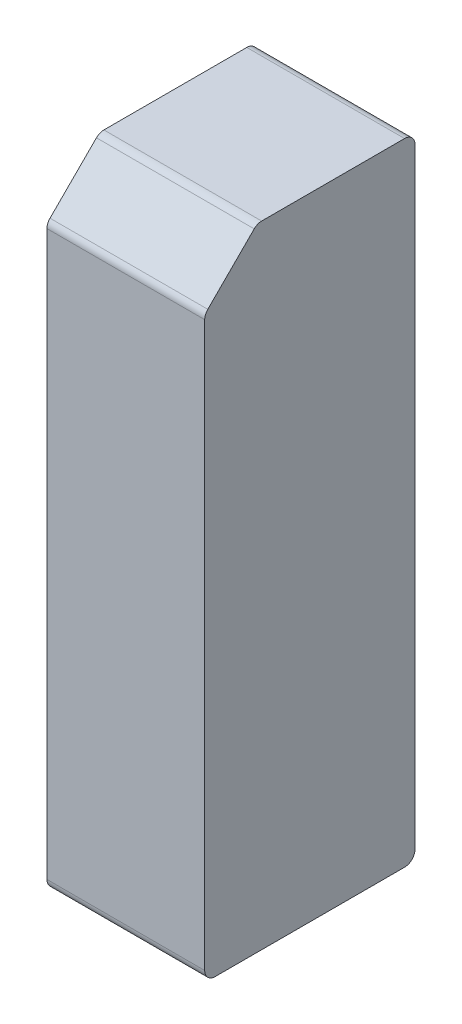
ISO-10303-21;
HEADER;
FILE_DESCRIPTION(('STEP AP214'),'2;1');
FILE_NAME('part.step','',(''),(''),'','','');
FILE_SCHEMA(('AUTOMOTIVE_DESIGN { 1 0 10303 214 1 1 1 1 }'));
ENDSEC;
DATA;
#1=APPLICATION_CONTEXT('core data for automotive mechanical design processes');
#2=APPLICATION_PROTOCOL_DEFINITION('international standard','automotive_design',2000,#1);
#3=PRODUCT_CONTEXT('',#1,'mechanical');
#4=PRODUCT('Part','Part','',(#3));
#5=PRODUCT_RELATED_PRODUCT_CATEGORY('part','',(#4));
#6=PRODUCT_DEFINITION_FORMATION('','',#4);
#7=PRODUCT_DEFINITION_CONTEXT('part definition',#1,'design');
#8=PRODUCT_DEFINITION('design','',#6,#7);
#9=PRODUCT_DEFINITION_SHAPE('','',#8);
#10=(LENGTH_UNIT() NAMED_UNIT(*) SI_UNIT(.MILLI.,.METRE.));
#11=(NAMED_UNIT(*) PLANE_ANGLE_UNIT() SI_UNIT($,.RADIAN.));
#12=(NAMED_UNIT(*) SI_UNIT($,.STERADIAN.) SOLID_ANGLE_UNIT());
#13=UNCERTAINTY_MEASURE_WITH_UNIT(LENGTH_MEASURE(1.E-05),#10,'distance_accuracy_value','');
#14=(GEOMETRIC_REPRESENTATION_CONTEXT(3) GLOBAL_UNCERTAINTY_ASSIGNED_CONTEXT((#13)) GLOBAL_UNIT_ASSIGNED_CONTEXT((#10,
#11,#12)) REPRESENTATION_CONTEXT('',''));
#15=CARTESIAN_POINT('',(0.,0.,0.));
#16=DIRECTION('',(0.,0.,1.));
#17=DIRECTION('',(1.,0.,0.));
#18=AXIS2_PLACEMENT_3D('',#15,#16,#17);
#19=CARTESIAN_POINT('',(9.525,20.6375,3.175));
#20=DIRECTION('',(0.,-1.,0.));
#21=DIRECTION('',(0.,0.,-1.));
#22=AXIS2_PLACEMENT_3D('',#19,#20,#21);
#23=PLANE('',#22);
#24=DIRECTION('',(0.,0.,1.));
#25=VECTOR('',#24,1.);
#26=CARTESIAN_POINT('',(9.525,20.6375,3.175));
#27=LINE('',#26,#25);
#28=CARTESIAN_POINT('',(9.525,20.6375,-5.715));
#29=VERTEX_POINT('',#28);
#30=CARTESIAN_POINT('',(9.525,20.6375,2.91197438789309));
#31=VERTEX_POINT('',#30);
#32=EDGE_CURVE('E212',#29,#31,#27,.T.);
#33=ORIENTED_EDGE('',*,*,#32,.F.);
#34=DIRECTION('',(-1.,0.,0.));
#35=VECTOR('',#34,1.);
#36=CARTESIAN_POINT('',(9.525,20.6375,-5.715));
#37=LINE('',#36,#35);
#38=CARTESIAN_POINT('',(0.,20.6375,-5.715));
#39=VERTEX_POINT('',#38);
#40=EDGE_CURVE('E199',#29,#39,#37,.T.);
#41=ORIENTED_EDGE('',*,*,#40,.T.);
#42=DIRECTION('',(0.,0.,1.));
#43=VECTOR('',#42,1.);
#44=CARTESIAN_POINT('',(0.,20.6375,3.175));
#45=LINE('',#44,#43);
#46=CARTESIAN_POINT('',(0.,20.6375,2.91197438789309));
#47=VERTEX_POINT('',#46);
#48=EDGE_CURVE('E221',#39,#47,#45,.T.);
#49=ORIENTED_EDGE('',*,*,#48,.T.);
#50=DIRECTION('',(-1.,0.,0.));
#51=VECTOR('',#50,1.);
#52=CARTESIAN_POINT('',(9.525,20.6375,2.91197438789309));
#53=LINE('',#52,#51);
#54=EDGE_CURVE('E196',#47,#31,#53,.F.);
#55=ORIENTED_EDGE('',*,*,#54,.T.);
#56=EDGE_LOOP('',(#33,#41,#49,#55));
#57=FACE_BOUND('',#56,.T.);
#58=ADVANCED_FACE('F38',(#57),#23,.F.);
#59=CARTESIAN_POINT('',(9.525,17.4625,6.35));
#60=DIRECTION('',(0.,-0.707106781186546,-0.707106781186549));
#61=DIRECTION('',(0.,0.707106781186549,-0.707106781186546));
#62=AXIS2_PLACEMENT_3D('',#59,#60,#61);
#63=PLANE('',#62);
#64=DIRECTION('',(0.,-0.707106781186549,0.707106781186546));
#65=VECTOR('',#64,1.);
#66=CARTESIAN_POINT('',(9.525,17.4625,6.35));
#67=LINE('',#66,#65);
#68=CARTESIAN_POINT('',(9.525,20.4515128060535,3.36098719394654));
#69=VERTEX_POINT('',#68);
#70=CARTESIAN_POINT('',(9.525,17.6484871939465,6.16401280605346));
#71=VERTEX_POINT('',#70);
#72=EDGE_CURVE('E209',#69,#71,#67,.T.);
#73=ORIENTED_EDGE('',*,*,#72,.F.);
#74=DIRECTION('',(-1.,0.,0.));
#75=VECTOR('',#74,1.);
#76=CARTESIAN_POINT('',(9.525,20.4515128060535,3.36098719394654));
#77=LINE('',#76,#75);
#78=CARTESIAN_POINT('',(0.,20.4515128060535,3.36098719394654));
#79=VERTEX_POINT('',#78);
#80=EDGE_CURVE('E11',#69,#79,#77,.T.);
#81=ORIENTED_EDGE('',*,*,#80,.T.);
#82=DIRECTION('',(0.,-0.707106781186549,0.707106781186546));
#83=VECTOR('',#82,1.);
#84=CARTESIAN_POINT('',(0.,17.4625,6.35));
#85=LINE('',#84,#83);
#86=CARTESIAN_POINT('',(0.,17.6484871939465,6.16401280605346));
#87=VERTEX_POINT('',#86);
#88=EDGE_CURVE('E154',#79,#87,#85,.T.);
#89=ORIENTED_EDGE('',*,*,#88,.T.);
#90=DIRECTION('',(-1.,0.,0.));
#91=VECTOR('',#90,1.);
#92=CARTESIAN_POINT('',(9.525,17.6484871939465,6.16401280605346));
#93=LINE('',#92,#91);
#94=EDGE_CURVE('E47',#87,#71,#93,.F.);
#95=ORIENTED_EDGE('',*,*,#94,.T.);
#96=EDGE_LOOP('',(#73,#81,#89,#95));
#97=FACE_BOUND('',#96,.T.);
#98=ADVANCED_FACE('F226',(#97),#63,.F.);
#99=CARTESIAN_POINT('',(9.525,-17.4625,6.35));
#100=DIRECTION('',(0.,0.,-1.));
#101=DIRECTION('',(-1.,0.,0.));
#102=AXIS2_PLACEMENT_3D('',#99,#100,#101);
#103=PLANE('',#102);
#104=DIRECTION('',(0.,-1.,0.));
#105=VECTOR('',#104,1.);
#106=CARTESIAN_POINT('',(0.,-17.4625,6.35));
#107=LINE('',#106,#105);
#108=CARTESIAN_POINT('',(0.,17.1994743878931,6.35));
#109=VERTEX_POINT('',#108);
#110=CARTESIAN_POINT('',(0.,-16.8275,6.35));
#111=VERTEX_POINT('',#110);
#112=EDGE_CURVE('E147',#109,#111,#107,.T.);
#113=ORIENTED_EDGE('',*,*,#112,.T.);
#114=DIRECTION('',(-1.,0.,0.));
#115=VECTOR('',#114,1.);
#116=CARTESIAN_POINT('',(9.525,-16.8275,6.35));
#117=LINE('',#116,#115);
#118=CARTESIAN_POINT('',(9.525,-16.8275,6.35));
#119=VERTEX_POINT('',#118);
#120=EDGE_CURVE('E122',#111,#119,#117,.F.);
#121=ORIENTED_EDGE('',*,*,#120,.T.);
#122=DIRECTION('',(0.,-1.,0.));
#123=VECTOR('',#122,1.);
#124=CARTESIAN_POINT('',(9.525,-17.4625,6.35));
#125=LINE('',#124,#123);
#126=CARTESIAN_POINT('',(9.525,17.1994743878931,6.35));
#127=VERTEX_POINT('',#126);
#128=EDGE_CURVE('E205',#127,#119,#125,.T.);
#129=ORIENTED_EDGE('',*,*,#128,.F.);
#130=DIRECTION('',(-1.,0.,0.));
#131=VECTOR('',#130,1.);
#132=CARTESIAN_POINT('',(9.525,17.1994743878931,6.35));
#133=LINE('',#132,#131);
#134=EDGE_CURVE('E128',#127,#109,#133,.T.);
#135=ORIENTED_EDGE('',*,*,#134,.T.);
#136=EDGE_LOOP('',(#113,#121,#129,#135));
#137=FACE_BOUND('',#136,.T.);
#138=ADVANCED_FACE('F234',(#137),#103,.F.);
#139=CARTESIAN_POINT('',(9.525,-17.4625,6.35));
#140=DIRECTION('',(0.,1.,0.));
#141=DIRECTION('',(0.,0.,1.));
#142=AXIS2_PLACEMENT_3D('',#139,#140,#141);
#143=PLANE('',#142);
#144=DIRECTION('',(0.,0.,-1.));
#145=VECTOR('',#144,1.);
#146=CARTESIAN_POINT('',(9.525,-17.4625,6.35));
#147=LINE('',#146,#145);
#148=CARTESIAN_POINT('',(9.525,-17.4625,5.715));
#149=VERTEX_POINT('',#148);
#150=CARTESIAN_POINT('',(9.525,-17.4625,-5.715));
#151=VERTEX_POINT('',#150);
#152=EDGE_CURVE('E138',#149,#151,#147,.T.);
#153=ORIENTED_EDGE('',*,*,#152,.F.);
#154=DIRECTION('',(-1.,0.,0.));
#155=VECTOR('',#154,1.);
#156=CARTESIAN_POINT('',(9.525,-17.4625,5.715));
#157=LINE('',#156,#155);
#158=CARTESIAN_POINT('',(0.,-17.4625,5.715));
#159=VERTEX_POINT('',#158);
#160=EDGE_CURVE('E121',#149,#159,#157,.T.);
#161=ORIENTED_EDGE('',*,*,#160,.T.);
#162=DIRECTION('',(0.,0.,-1.));
#163=VECTOR('',#162,1.);
#164=CARTESIAN_POINT('',(0.,-17.4625,6.35));
#165=LINE('',#164,#163);
#166=CARTESIAN_POINT('',(0.,-17.4625,-5.715));
#167=VERTEX_POINT('',#166);
#168=EDGE_CURVE('E135',#159,#167,#165,.T.);
#169=ORIENTED_EDGE('',*,*,#168,.T.);
#170=DIRECTION('',(-1.,0.,0.));
#171=VECTOR('',#170,1.);
#172=CARTESIAN_POINT('',(9.525,-17.4625,-5.715));
#173=LINE('',#172,#171);
#174=EDGE_CURVE('E141',#167,#151,#173,.F.);
#175=ORIENTED_EDGE('',*,*,#174,.T.);
#176=EDGE_LOOP('',(#153,#161,#169,#175));
#177=FACE_BOUND('',#176,.T.);
#178=ADVANCED_FACE('F134',(#177),#143,.F.);
#179=CARTESIAN_POINT('',(9.525,-17.4625,-6.35));
#180=DIRECTION('',(0.,0.,1.));
#181=DIRECTION('',(1.,0.,0.));
#182=AXIS2_PLACEMENT_3D('',#179,#180,#181);
#183=PLANE('',#182);
#184=DIRECTION('',(0.,1.,0.));
#185=VECTOR('',#184,1.);
#186=CARTESIAN_POINT('',(9.525,20.6375,-6.35));
#187=LINE('',#186,#185);
#188=CARTESIAN_POINT('',(9.525,-16.8275,-6.35));
#189=VERTEX_POINT('',#188);
#190=CARTESIAN_POINT('',(9.525,20.0025,-6.35));
#191=VERTEX_POINT('',#190);
#192=EDGE_CURVE('E152',#189,#191,#187,.T.);
#193=ORIENTED_EDGE('',*,*,#192,.F.);
#194=DIRECTION('',(-1.,0.,0.));
#195=VECTOR('',#194,1.);
#196=CARTESIAN_POINT('',(9.525,-16.8275,-6.35));
#197=LINE('',#196,#195);
#198=CARTESIAN_POINT('',(0.,-16.8275,-6.35));
#199=VERTEX_POINT('',#198);
#200=EDGE_CURVE('E192',#189,#199,#197,.T.);
#201=ORIENTED_EDGE('',*,*,#200,.T.);
#202=DIRECTION('',(0.,1.,0.));
#203=VECTOR('',#202,1.);
#204=CARTESIAN_POINT('',(0.,-17.4625,-6.35));
#205=LINE('',#204,#203);
#206=CARTESIAN_POINT('',(0.,20.0025,-6.35));
#207=VERTEX_POINT('',#206);
#208=EDGE_CURVE('E146',#199,#207,#205,.T.);
#209=ORIENTED_EDGE('',*,*,#208,.T.);
#210=DIRECTION('',(-1.,0.,0.));
#211=VECTOR('',#210,1.);
#212=CARTESIAN_POINT('',(9.525,20.0025,-6.35));
#213=LINE('',#212,#211);
#214=EDGE_CURVE('E189',#207,#191,#213,.F.);
#215=ORIENTED_EDGE('',*,*,#214,.T.);
#216=EDGE_LOOP('',(#193,#201,#209,#215));
#217=FACE_BOUND('',#216,.T.);
#218=ADVANCED_FACE('F241',(#217),#183,.F.);
#219=CARTESIAN_POINT('',(9.525,0.,0.));
#220=DIRECTION('',(1.,0.,0.));
#221=DIRECTION('',(0.,0.,-1.));
#222=AXIS2_PLACEMENT_3D('',#219,#220,#221);
#223=PLANE('',#222);
#224=ORIENTED_EDGE('',*,*,#128,.T.);
#225=CARTESIAN_POINT('',(9.525,-16.8275,5.715));
#226=DIRECTION('',(1.,0.,0.));
#227=DIRECTION('',(0.,0.,-1.));
#228=AXIS2_PLACEMENT_3D('',#225,#226,#227);
#229=CIRCLE('',#228,0.635);
#230=EDGE_CURVE('E186',#119,#149,#229,.T.);
#231=ORIENTED_EDGE('',*,*,#230,.T.);
#232=ORIENTED_EDGE('',*,*,#152,.T.);
#233=CARTESIAN_POINT('',(9.525,-16.8275,-5.715));
#234=DIRECTION('',(1.,0.,0.));
#235=DIRECTION('',(0.,0.,-1.));
#236=AXIS2_PLACEMENT_3D('',#233,#234,#235);
#237=CIRCLE('',#236,0.635);
#238=EDGE_CURVE('E183',#151,#189,#237,.T.);
#239=ORIENTED_EDGE('',*,*,#238,.T.);
#240=ORIENTED_EDGE('',*,*,#192,.T.);
#241=CARTESIAN_POINT('',(9.525,20.0025,-5.715));
#242=DIRECTION('',(1.,0.,0.));
#243=DIRECTION('',(0.,0.,-1.));
#244=AXIS2_PLACEMENT_3D('',#241,#242,#243);
#245=CIRCLE('',#244,0.635);
#246=EDGE_CURVE('E180',#191,#29,#245,.T.);
#247=ORIENTED_EDGE('',*,*,#246,.T.);
#248=ORIENTED_EDGE('',*,*,#32,.T.);
#249=CARTESIAN_POINT('',(9.525,20.0025,2.91197438789309));
#250=DIRECTION('',(1.,0.,0.));
#251=DIRECTION('',(0.,0.,-1.));
#252=AXIS2_PLACEMENT_3D('',#249,#250,#251);
#253=CIRCLE('',#252,0.635);
#254=EDGE_CURVE('E60',#31,#69,#253,.T.);
#255=ORIENTED_EDGE('',*,*,#254,.T.);
#256=ORIENTED_EDGE('',*,*,#72,.T.);
#257=CARTESIAN_POINT('',(9.525,17.1994743878931,5.715));
#258=DIRECTION('',(1.,0.,0.));
#259=DIRECTION('',(0.,0.,-1.));
#260=AXIS2_PLACEMENT_3D('',#257,#258,#259);
#261=CIRCLE('',#260,0.635);
#262=EDGE_CURVE('E175',#71,#127,#261,.T.);
#263=ORIENTED_EDGE('',*,*,#262,.T.);
#264=EDGE_LOOP('',(#224,#231,#232,#239,#240,#247,#248,#255,#256,#263));
#265=FACE_BOUND('',#264,.T.);
#266=ADVANCED_FACE('F232',(#265),#223,.T.);
#267=CARTESIAN_POINT('',(0.,0.,0.));
#268=DIRECTION('',(1.,0.,0.));
#269=DIRECTION('',(0.,0.,-1.));
#270=AXIS2_PLACEMENT_3D('',#267,#268,#269);
#271=PLANE('',#270);
#272=ORIENTED_EDGE('',*,*,#168,.F.);
#273=CARTESIAN_POINT('',(0.,-16.8275,5.715));
#274=DIRECTION('',(1.,0.,0.));
#275=DIRECTION('',(0.,0.,-1.));
#276=AXIS2_PLACEMENT_3D('',#273,#274,#275);
#277=CIRCLE('',#276,0.635);
#278=EDGE_CURVE('E117',#159,#111,#277,.F.);
#279=ORIENTED_EDGE('',*,*,#278,.T.);
#280=ORIENTED_EDGE('',*,*,#112,.F.);
#281=CARTESIAN_POINT('',(0.,17.1994743878931,5.715));
#282=DIRECTION('',(1.,0.,0.));
#283=DIRECTION('',(0.,0.,-1.));
#284=AXIS2_PLACEMENT_3D('',#281,#282,#283);
#285=CIRCLE('',#284,0.635);
#286=EDGE_CURVE('E140',#109,#87,#285,.F.);
#287=ORIENTED_EDGE('',*,*,#286,.T.);
#288=ORIENTED_EDGE('',*,*,#88,.F.);
#289=CARTESIAN_POINT('',(0.,20.0025,2.91197438789309));
#290=DIRECTION('',(1.,0.,0.));
#291=DIRECTION('',(0.,0.,-1.));
#292=AXIS2_PLACEMENT_3D('',#289,#290,#291);
#293=CIRCLE('',#292,0.635);
#294=EDGE_CURVE('E162',#79,#47,#293,.F.);
#295=ORIENTED_EDGE('',*,*,#294,.T.);
#296=ORIENTED_EDGE('',*,*,#48,.F.);
#297=CARTESIAN_POINT('',(0.,20.0025,-5.715));
#298=DIRECTION('',(1.,0.,0.));
#299=DIRECTION('',(0.,0.,-1.));
#300=AXIS2_PLACEMENT_3D('',#297,#298,#299);
#301=CIRCLE('',#300,0.635);
#302=EDGE_CURVE('E165',#39,#207,#301,.F.);
#303=ORIENTED_EDGE('',*,*,#302,.T.);
#304=ORIENTED_EDGE('',*,*,#208,.F.);
#305=CARTESIAN_POINT('',(0.,-16.8275,-5.715));
#306=DIRECTION('',(1.,0.,0.));
#307=DIRECTION('',(0.,0.,-1.));
#308=AXIS2_PLACEMENT_3D('',#305,#306,#307);
#309=CIRCLE('',#308,0.635);
#310=EDGE_CURVE('E129',#199,#167,#309,.F.);
#311=ORIENTED_EDGE('',*,*,#310,.T.);
#312=EDGE_LOOP('',(#272,#279,#280,#287,#288,#295,#296,#303,#304,#311));
#313=FACE_BOUND('',#312,.T.);
#314=ADVANCED_FACE('F143',(#313),#271,.F.);
#315=CARTESIAN_POINT('',(9.525,-16.8275,5.715));
#316=DIRECTION('',(-1.,0.,0.));
#317=DIRECTION('',(0.,0.,1.));
#318=AXIS2_PLACEMENT_3D('',#315,#316,#317);
#319=CYLINDRICAL_SURFACE('',#318,0.635);
#320=ORIENTED_EDGE('',*,*,#230,.F.);
#321=ORIENTED_EDGE('',*,*,#120,.F.);
#322=ORIENTED_EDGE('',*,*,#278,.F.);
#323=ORIENTED_EDGE('',*,*,#160,.F.);
#324=EDGE_LOOP('',(#320,#321,#322,#323));
#325=FACE_BOUND('',#324,.T.);
#326=ADVANCED_FACE('F120',(#325),#319,.T.);
#327=CARTESIAN_POINT('',(9.525,-16.8275,-5.715));
#328=DIRECTION('',(-1.,0.,0.));
#329=DIRECTION('',(0.,0.,1.));
#330=AXIS2_PLACEMENT_3D('',#327,#328,#329);
#331=CYLINDRICAL_SURFACE('',#330,0.635);
#332=ORIENTED_EDGE('',*,*,#238,.F.);
#333=ORIENTED_EDGE('',*,*,#174,.F.);
#334=ORIENTED_EDGE('',*,*,#310,.F.);
#335=ORIENTED_EDGE('',*,*,#200,.F.);
#336=EDGE_LOOP('',(#332,#333,#334,#335));
#337=FACE_BOUND('',#336,.T.);
#338=ADVANCED_FACE('F253',(#337),#331,.T.);
#339=CARTESIAN_POINT('',(9.525,20.0025,-5.715));
#340=DIRECTION('',(-1.,0.,0.));
#341=DIRECTION('',(0.,0.,1.));
#342=AXIS2_PLACEMENT_3D('',#339,#340,#341);
#343=CYLINDRICAL_SURFACE('',#342,0.635);
#344=ORIENTED_EDGE('',*,*,#246,.F.);
#345=ORIENTED_EDGE('',*,*,#214,.F.);
#346=ORIENTED_EDGE('',*,*,#302,.F.);
#347=ORIENTED_EDGE('',*,*,#40,.F.);
#348=EDGE_LOOP('',(#344,#345,#346,#347));
#349=FACE_BOUND('',#348,.T.);
#350=ADVANCED_FACE('F256',(#349),#343,.T.);
#351=CARTESIAN_POINT('',(9.525,20.0025,2.91197438789309));
#352=DIRECTION('',(-1.,0.,0.));
#353=DIRECTION('',(0.,0.,1.));
#354=AXIS2_PLACEMENT_3D('',#351,#352,#353);
#355=CYLINDRICAL_SURFACE('',#354,0.635);
#356=ORIENTED_EDGE('',*,*,#254,.F.);
#357=ORIENTED_EDGE('',*,*,#54,.F.);
#358=ORIENTED_EDGE('',*,*,#294,.F.);
#359=ORIENTED_EDGE('',*,*,#80,.F.);
#360=EDGE_LOOP('',(#356,#357,#358,#359));
#361=FACE_BOUND('',#360,.T.);
#362=ADVANCED_FACE('F259',(#361),#355,.T.);
#363=CARTESIAN_POINT('',(9.525,17.1994743878931,5.715));
#364=DIRECTION('',(-1.,0.,0.));
#365=DIRECTION('',(0.,0.,1.));
#366=AXIS2_PLACEMENT_3D('',#363,#364,#365);
#367=CYLINDRICAL_SURFACE('',#366,0.635);
#368=ORIENTED_EDGE('',*,*,#262,.F.);
#369=ORIENTED_EDGE('',*,*,#94,.F.);
#370=ORIENTED_EDGE('',*,*,#286,.F.);
#371=ORIENTED_EDGE('',*,*,#134,.F.);
#372=EDGE_LOOP('',(#368,#369,#370,#371));
#373=FACE_BOUND('',#372,.T.);
#374=ADVANCED_FACE('F40',(#373),#367,.T.);
#375=CLOSED_SHELL('',(#58,#98,#138,#178,#218,#266,#314,#326,#338,#350,#362,#374));
#376=MANIFOLD_SOLID_BREP('B2',#375);
#377=ADVANCED_BREP_SHAPE_REPRESENTATION('',(#18,#376),#14);
#378=SHAPE_DEFINITION_REPRESENTATION(#9,#377);
ENDSEC;
END-ISO-10303-21;
